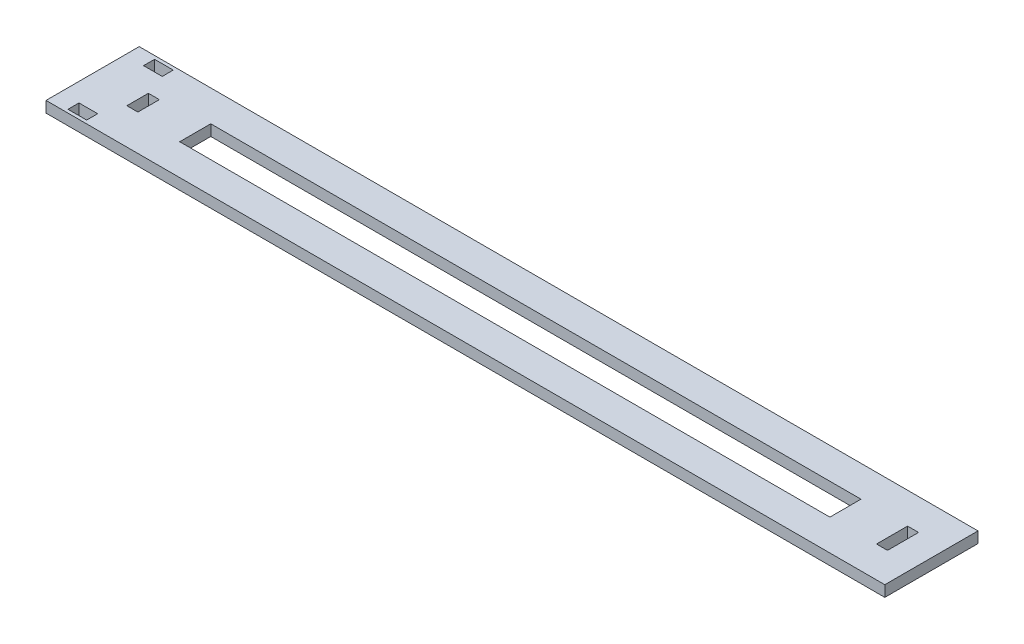
ISO-10303-21;
HEADER;
FILE_DESCRIPTION(('STEP AP214'),'2;1');
FILE_NAME('part.step','',(''),(''),'','','');
FILE_SCHEMA(('AUTOMOTIVE_DESIGN { 1 0 10303 214 1 1 1 1 }'));
ENDSEC;
DATA;
#1=APPLICATION_CONTEXT('core data for automotive mechanical design processes');
#2=APPLICATION_PROTOCOL_DEFINITION('international standard','automotive_design',2000,#1);
#3=PRODUCT_CONTEXT('',#1,'mechanical');
#4=PRODUCT('Part','Part','',(#3));
#5=PRODUCT_RELATED_PRODUCT_CATEGORY('part','',(#4));
#6=PRODUCT_DEFINITION_FORMATION('','',#4);
#7=PRODUCT_DEFINITION_CONTEXT('part definition',#1,'design');
#8=PRODUCT_DEFINITION('design','',#6,#7);
#9=PRODUCT_DEFINITION_SHAPE('','',#8);
#10=(LENGTH_UNIT() NAMED_UNIT(*) SI_UNIT(.MILLI.,.METRE.));
#11=(NAMED_UNIT(*) PLANE_ANGLE_UNIT() SI_UNIT($,.RADIAN.));
#12=(NAMED_UNIT(*) SI_UNIT($,.STERADIAN.) SOLID_ANGLE_UNIT());
#13=UNCERTAINTY_MEASURE_WITH_UNIT(LENGTH_MEASURE(1.E-05),#10,'distance_accuracy_value','');
#14=(GEOMETRIC_REPRESENTATION_CONTEXT(3) GLOBAL_UNCERTAINTY_ASSIGNED_CONTEXT((#13)) GLOBAL_UNIT_ASSIGNED_CONTEXT((#10,
#11,#12)) REPRESENTATION_CONTEXT('',''));
#15=CARTESIAN_POINT('',(0.,0.,0.));
#16=DIRECTION('',(0.,0.,1.));
#17=DIRECTION('',(1.,0.,0.));
#18=AXIS2_PLACEMENT_3D('',#15,#16,#17);
#19=CARTESIAN_POINT('',(0.,6.,0.));
#20=DIRECTION('',(1.,0.,0.));
#21=DIRECTION('',(0.,0.,-1.));
#22=AXIS2_PLACEMENT_3D('',#19,#20,#21);
#23=PLANE('',#22);
#24=DIRECTION('',(0.,0.,1.));
#25=VECTOR('',#24,1.);
#26=CARTESIAN_POINT('',(0.,0.,0.));
#27=LINE('',#26,#25);
#28=CARTESIAN_POINT('',(0.,0.,-50.8));
#29=VERTEX_POINT('',#28);
#30=CARTESIAN_POINT('',(0.,0.,0.));
#31=VERTEX_POINT('',#30);
#32=EDGE_CURVE('E354',#29,#31,#27,.T.);
#33=ORIENTED_EDGE('',*,*,#32,.T.);
#34=DIRECTION('',(0.,-1.,0.));
#35=VECTOR('',#34,1.);
#36=CARTESIAN_POINT('',(0.,6.,0.));
#37=LINE('',#36,#35);
#38=CARTESIAN_POINT('',(0.,6.,0.));
#39=VERTEX_POINT('',#38);
#40=EDGE_CURVE('E11',#39,#31,#37,.T.);
#41=ORIENTED_EDGE('',*,*,#40,.F.);
#42=DIRECTION('',(0.,0.,1.));
#43=VECTOR('',#42,1.);
#44=CARTESIAN_POINT('',(0.,6.,0.));
#45=LINE('',#44,#43);
#46=CARTESIAN_POINT('',(0.,6.,-50.8));
#47=VERTEX_POINT('',#46);
#48=EDGE_CURVE('E355',#47,#39,#45,.T.);
#49=ORIENTED_EDGE('',*,*,#48,.F.);
#50=DIRECTION('',(0.,-1.,0.));
#51=VECTOR('',#50,1.);
#52=CARTESIAN_POINT('',(0.,6.,-50.8));
#53=LINE('',#52,#51);
#54=EDGE_CURVE('E365',#47,#29,#53,.T.);
#55=ORIENTED_EDGE('',*,*,#54,.T.);
#56=EDGE_LOOP('',(#33,#41,#49,#55));
#57=FACE_BOUND('',#56,.T.);
#58=ADVANCED_FACE('F32',(#57),#23,.F.);
#59=CARTESIAN_POINT('',(0.,6.,0.));
#60=DIRECTION('',(0.,0.,-1.));
#61=DIRECTION('',(-1.,0.,0.));
#62=AXIS2_PLACEMENT_3D('',#59,#60,#61);
#63=PLANE('',#62);
#64=DIRECTION('',(1.,0.,0.));
#65=VECTOR('',#64,1.);
#66=CARTESIAN_POINT('',(0.,0.,0.));
#67=LINE('',#66,#65);
#68=CARTESIAN_POINT('',(457.2,0.,0.));
#69=VERTEX_POINT('',#68);
#70=EDGE_CURVE('E368',#31,#69,#67,.T.);
#71=ORIENTED_EDGE('',*,*,#70,.T.);
#72=DIRECTION('',(0.,-1.,0.));
#73=VECTOR('',#72,1.);
#74=CARTESIAN_POINT('',(457.2,6.,0.));
#75=LINE('',#74,#73);
#76=CARTESIAN_POINT('',(457.2,6.,0.));
#77=VERTEX_POINT('',#76);
#78=EDGE_CURVE('E39',#77,#69,#75,.T.);
#79=ORIENTED_EDGE('',*,*,#78,.F.);
#80=DIRECTION('',(1.,0.,0.));
#81=VECTOR('',#80,1.);
#82=CARTESIAN_POINT('',(0.,6.,0.));
#83=LINE('',#82,#81);
#84=EDGE_CURVE('E358',#39,#77,#83,.T.);
#85=ORIENTED_EDGE('',*,*,#84,.F.);
#86=ORIENTED_EDGE('',*,*,#40,.T.);
#87=EDGE_LOOP('',(#71,#79,#85,#86));
#88=FACE_BOUND('',#87,.T.);
#89=ADVANCED_FACE('F397',(#88),#63,.F.);
#90=CARTESIAN_POINT('',(457.2,6.,0.));
#91=DIRECTION('',(-1.,0.,0.));
#92=DIRECTION('',(0.,0.,1.));
#93=AXIS2_PLACEMENT_3D('',#90,#91,#92);
#94=PLANE('',#93);
#95=DIRECTION('',(0.,0.,-1.));
#96=VECTOR('',#95,1.);
#97=CARTESIAN_POINT('',(457.2,0.,0.));
#98=LINE('',#97,#96);
#99=CARTESIAN_POINT('',(457.2,0.,-50.8));
#100=VERTEX_POINT('',#99);
#101=EDGE_CURVE('E370',#69,#100,#98,.T.);
#102=ORIENTED_EDGE('',*,*,#101,.T.);
#103=DIRECTION('',(0.,-1.,0.));
#104=VECTOR('',#103,1.);
#105=CARTESIAN_POINT('',(457.2,6.,-50.8));
#106=LINE('',#105,#104);
#107=CARTESIAN_POINT('',(457.2,6.,-50.8));
#108=VERTEX_POINT('',#107);
#109=EDGE_CURVE('E375',#108,#100,#106,.T.);
#110=ORIENTED_EDGE('',*,*,#109,.F.);
#111=DIRECTION('',(0.,0.,-1.));
#112=VECTOR('',#111,1.);
#113=CARTESIAN_POINT('',(457.2,6.,0.));
#114=LINE('',#113,#112);
#115=EDGE_CURVE('E361',#77,#108,#114,.T.);
#116=ORIENTED_EDGE('',*,*,#115,.F.);
#117=ORIENTED_EDGE('',*,*,#78,.T.);
#118=EDGE_LOOP('',(#102,#110,#116,#117));
#119=FACE_BOUND('',#118,.T.);
#120=ADVANCED_FACE('F382',(#119),#94,.F.);
#121=CARTESIAN_POINT('',(0.,6.,-50.8));
#122=DIRECTION('',(0.,0.,1.));
#123=DIRECTION('',(1.,0.,0.));
#124=AXIS2_PLACEMENT_3D('',#121,#122,#123);
#125=PLANE('',#124);
#126=DIRECTION('',(-1.,0.,0.));
#127=VECTOR('',#126,1.);
#128=CARTESIAN_POINT('',(0.,0.,-50.8));
#129=LINE('',#128,#127);
#130=EDGE_CURVE('E359',#100,#29,#129,.T.);
#131=ORIENTED_EDGE('',*,*,#130,.T.);
#132=ORIENTED_EDGE('',*,*,#54,.F.);
#133=DIRECTION('',(-1.,0.,0.));
#134=VECTOR('',#133,1.);
#135=CARTESIAN_POINT('',(0.,6.,-50.8));
#136=LINE('',#135,#134);
#137=EDGE_CURVE('E363',#108,#47,#136,.T.);
#138=ORIENTED_EDGE('',*,*,#137,.F.);
#139=ORIENTED_EDGE('',*,*,#109,.T.);
#140=EDGE_LOOP('',(#131,#132,#138,#139));
#141=FACE_BOUND('',#140,.T.);
#142=ADVANCED_FACE('F390',(#141),#125,.F.);
#143=CARTESIAN_POINT('',(0.,6.,0.));
#144=DIRECTION('',(0.,-1.,0.));
#145=DIRECTION('',(0.,0.,-1.));
#146=AXIS2_PLACEMENT_3D('',#143,#144,#145);
#147=PLANE('',#146);
#148=DIRECTION('',(0.,0.,-1.));
#149=VECTOR('',#148,1.);
#150=CARTESIAN_POINT('',(410.34,6.,-33.8666666666667));
#151=LINE('',#150,#149);
#152=CARTESIAN_POINT('',(410.34,6.,-16.9333333333334));
#153=VERTEX_POINT('',#152);
#154=CARTESIAN_POINT('',(410.34,6.,-33.8666666666667));
#155=VERTEX_POINT('',#154);
#156=EDGE_CURVE('E209',#153,#155,#151,.T.);
#157=ORIENTED_EDGE('',*,*,#156,.F.);
#158=DIRECTION('',(1.,0.,0.));
#159=VECTOR('',#158,1.);
#160=CARTESIAN_POINT('',(214.894666784463,6.,-16.9333333333333));
#161=LINE('',#160,#159);
#162=CARTESIAN_POINT('',(55.94,6.,-16.9333333333333));
#163=VERTEX_POINT('',#162);
#164=EDGE_CURVE('E46',#163,#153,#161,.T.);
#165=ORIENTED_EDGE('',*,*,#164,.F.);
#166=DIRECTION('',(0.,0.,1.));
#167=VECTOR('',#166,1.);
#168=CARTESIAN_POINT('',(55.94,6.,-16.9333333333333));
#169=LINE('',#168,#167);
#170=CARTESIAN_POINT('',(55.94,6.,-33.8666666666667));
#171=VERTEX_POINT('',#170);
#172=EDGE_CURVE('E219',#171,#163,#169,.T.);
#173=ORIENTED_EDGE('',*,*,#172,.F.);
#174=DIRECTION('',(-1.,0.,0.));
#175=VECTOR('',#174,1.);
#176=CARTESIAN_POINT('',(55.94,6.,-33.8666666666667));
#177=LINE('',#176,#175);
#178=EDGE_CURVE('E211',#155,#171,#177,.T.);
#179=ORIENTED_EDGE('',*,*,#178,.F.);
#180=EDGE_LOOP('',(#157,#165,#173,#179));
#181=FACE_BOUND('',#180,.T.);
#182=DIRECTION('',(1.,0.,0.));
#183=VECTOR('',#182,1.);
#184=CARTESIAN_POINT('',(10.18,6.,-43.));
#185=LINE('',#184,#183);
#186=CARTESIAN_POINT('',(10.18,6.,-43.));
#187=VERTEX_POINT('',#186);
#188=CARTESIAN_POINT('',(20.36,6.,-43.));
#189=VERTEX_POINT('',#188);
#190=EDGE_CURVE('E237',#187,#189,#185,.T.);
#191=ORIENTED_EDGE('',*,*,#190,.F.);
#192=DIRECTION('',(0.,0.,1.));
#193=VECTOR('',#192,1.);
#194=CARTESIAN_POINT('',(10.18,6.,-49.));
#195=LINE('',#194,#193);
#196=CARTESIAN_POINT('',(10.18,6.,-49.));
#197=VERTEX_POINT('',#196);
#198=EDGE_CURVE('E235',#197,#187,#195,.T.);
#199=ORIENTED_EDGE('',*,*,#198,.F.);
#200=DIRECTION('',(-1.,0.,0.));
#201=VECTOR('',#200,1.);
#202=CARTESIAN_POINT('',(10.18,6.,-49.));
#203=LINE('',#202,#201);
#204=CARTESIAN_POINT('',(20.36,6.,-49.));
#205=VERTEX_POINT('',#204);
#206=EDGE_CURVE('E243',#205,#197,#203,.T.);
#207=ORIENTED_EDGE('',*,*,#206,.F.);
#208=DIRECTION('',(0.,0.,-1.));
#209=VECTOR('',#208,1.);
#210=CARTESIAN_POINT('',(20.36,6.,-49.));
#211=LINE('',#210,#209);
#212=EDGE_CURVE('E240',#189,#205,#211,.T.);
#213=ORIENTED_EDGE('',*,*,#212,.F.);
#214=EDGE_LOOP('',(#191,#199,#207,#213));
#215=FACE_BOUND('',#214,.T.);
#216=DIRECTION('',(1.,0.,0.));
#217=VECTOR('',#216,1.);
#218=CARTESIAN_POINT('',(10.18,6.,-1.8));
#219=LINE('',#218,#217);
#220=CARTESIAN_POINT('',(10.18,6.,-1.8));
#221=VERTEX_POINT('',#220);
#222=CARTESIAN_POINT('',(20.36,6.,-1.8));
#223=VERTEX_POINT('',#222);
#224=EDGE_CURVE('E269',#221,#223,#219,.T.);
#225=ORIENTED_EDGE('',*,*,#224,.F.);
#226=DIRECTION('',(0.,0.,1.));
#227=VECTOR('',#226,1.);
#228=CARTESIAN_POINT('',(10.18,6.,-7.8));
#229=LINE('',#228,#227);
#230=CARTESIAN_POINT('',(10.18,6.,-7.8));
#231=VERTEX_POINT('',#230);
#232=EDGE_CURVE('E267',#231,#221,#229,.T.);
#233=ORIENTED_EDGE('',*,*,#232,.F.);
#234=DIRECTION('',(-1.,0.,0.));
#235=VECTOR('',#234,1.);
#236=CARTESIAN_POINT('',(10.18,6.,-7.8));
#237=LINE('',#236,#235);
#238=CARTESIAN_POINT('',(20.36,6.,-7.8));
#239=VERTEX_POINT('',#238);
#240=EDGE_CURVE('E275',#239,#231,#237,.T.);
#241=ORIENTED_EDGE('',*,*,#240,.F.);
#242=DIRECTION('',(0.,0.,-1.));
#243=VECTOR('',#242,1.);
#244=CARTESIAN_POINT('',(20.36,6.,-7.8));
#245=LINE('',#244,#243);
#246=EDGE_CURVE('E272',#223,#239,#245,.T.);
#247=ORIENTED_EDGE('',*,*,#246,.F.);
#248=EDGE_LOOP('',(#225,#233,#241,#247));
#249=FACE_BOUND('',#248,.T.);
#250=DIRECTION('',(1.,0.,0.));
#251=VECTOR('',#250,1.);
#252=CARTESIAN_POINT('',(24.54,6.,-19.5333333333333));
#253=LINE('',#252,#251);
#254=CARTESIAN_POINT('',(24.54,6.,-19.5333333333333));
#255=VERTEX_POINT('',#254);
#256=CARTESIAN_POINT('',(30.54,6.,-19.5333333333333));
#257=VERTEX_POINT('',#256);
#258=EDGE_CURVE('E301',#255,#257,#253,.T.);
#259=ORIENTED_EDGE('',*,*,#258,.F.);
#260=DIRECTION('',(0.,0.,1.));
#261=VECTOR('',#260,1.);
#262=CARTESIAN_POINT('',(24.54,6.,-31.2666666666667));
#263=LINE('',#262,#261);
#264=CARTESIAN_POINT('',(24.54,6.,-31.2666666666667));
#265=VERTEX_POINT('',#264);
#266=EDGE_CURVE('E299',#265,#255,#263,.T.);
#267=ORIENTED_EDGE('',*,*,#266,.F.);
#268=DIRECTION('',(-1.,0.,0.));
#269=VECTOR('',#268,1.);
#270=CARTESIAN_POINT('',(24.54,6.,-31.2666666666667));
#271=LINE('',#270,#269);
#272=CARTESIAN_POINT('',(30.54,6.,-31.2666666666667));
#273=VERTEX_POINT('',#272);
#274=EDGE_CURVE('E307',#273,#265,#271,.T.);
#275=ORIENTED_EDGE('',*,*,#274,.F.);
#276=DIRECTION('',(0.,0.,-1.));
#277=VECTOR('',#276,1.);
#278=CARTESIAN_POINT('',(30.54,6.,-31.2666666666667));
#279=LINE('',#278,#277);
#280=EDGE_CURVE('E304',#257,#273,#279,.T.);
#281=ORIENTED_EDGE('',*,*,#280,.F.);
#282=EDGE_LOOP('',(#259,#267,#275,#281));
#283=FACE_BOUND('',#282,.T.);
#284=DIRECTION('',(-1.,0.,0.));
#285=VECTOR('',#284,1.);
#286=CARTESIAN_POINT('',(441.74,6.,-33.8666666666667));
#287=LINE('',#286,#285);
#288=CARTESIAN_POINT('',(441.74,6.,-33.8666666666667));
#289=VERTEX_POINT('',#288);
#290=CARTESIAN_POINT('',(435.74,6.,-33.8666666666667));
#291=VERTEX_POINT('',#290);
#292=EDGE_CURVE('E333',#289,#291,#287,.T.);
#293=ORIENTED_EDGE('',*,*,#292,.F.);
#294=DIRECTION('',(0.,0.,-1.));
#295=VECTOR('',#294,1.);
#296=CARTESIAN_POINT('',(441.74,6.,-33.8666666666667));
#297=LINE('',#296,#295);
#298=CARTESIAN_POINT('',(441.74,6.,-16.9333333333333));
#299=VERTEX_POINT('',#298);
#300=EDGE_CURVE('E331',#299,#289,#297,.T.);
#301=ORIENTED_EDGE('',*,*,#300,.F.);
#302=DIRECTION('',(1.,0.,0.));
#303=VECTOR('',#302,1.);
#304=CARTESIAN_POINT('',(441.74,6.,-16.9333333333333));
#305=LINE('',#304,#303);
#306=CARTESIAN_POINT('',(435.74,6.,-16.9333333333333));
#307=VERTEX_POINT('',#306);
#308=EDGE_CURVE('E339',#307,#299,#305,.T.);
#309=ORIENTED_EDGE('',*,*,#308,.F.);
#310=DIRECTION('',(0.,0.,1.));
#311=VECTOR('',#310,1.);
#312=CARTESIAN_POINT('',(435.74,6.,-33.8666666666667));
#313=LINE('',#312,#311);
#314=EDGE_CURVE('E336',#291,#307,#313,.T.);
#315=ORIENTED_EDGE('',*,*,#314,.F.);
#316=EDGE_LOOP('',(#293,#301,#309,#315));
#317=FACE_BOUND('',#316,.T.);
#318=ORIENTED_EDGE('',*,*,#48,.T.);
#319=ORIENTED_EDGE('',*,*,#84,.T.);
#320=ORIENTED_EDGE('',*,*,#115,.T.);
#321=ORIENTED_EDGE('',*,*,#137,.T.);
#322=EDGE_LOOP('',(#318,#319,#320,#321));
#323=FACE_BOUND('',#322,.T.);
#324=ADVANCED_FACE('F396',(#181,#215,#249,#283,#317,#323),#147,.F.);
#325=CARTESIAN_POINT('',(0.,0.,0.));
#326=DIRECTION('',(0.,-1.,0.));
#327=DIRECTION('',(0.,0.,-1.));
#328=AXIS2_PLACEMENT_3D('',#325,#326,#327);
#329=PLANE('',#328);
#330=DIRECTION('',(1.,0.,0.));
#331=VECTOR('',#330,1.);
#332=CARTESIAN_POINT('',(214.894666784463,0.,-16.9333333333333));
#333=LINE('',#332,#331);
#334=CARTESIAN_POINT('',(55.94,0.,-16.9333333333333));
#335=VERTEX_POINT('',#334);
#336=CARTESIAN_POINT('',(410.34,0.,-16.9333333333334));
#337=VERTEX_POINT('',#336);
#338=EDGE_CURVE('E202',#335,#337,#333,.T.);
#339=ORIENTED_EDGE('',*,*,#338,.T.);
#340=DIRECTION('',(0.,0.,-1.));
#341=VECTOR('',#340,1.);
#342=CARTESIAN_POINT('',(410.34,0.,-33.8666666666667));
#343=LINE('',#342,#341);
#344=CARTESIAN_POINT('',(410.34,0.,-33.8666666666667));
#345=VERTEX_POINT('',#344);
#346=EDGE_CURVE('E191',#337,#345,#343,.T.);
#347=ORIENTED_EDGE('',*,*,#346,.T.);
#348=DIRECTION('',(-1.,0.,0.));
#349=VECTOR('',#348,1.);
#350=CARTESIAN_POINT('',(55.94,0.,-33.8666666666667));
#351=LINE('',#350,#349);
#352=CARTESIAN_POINT('',(55.94,0.,-33.8666666666667));
#353=VERTEX_POINT('',#352);
#354=EDGE_CURVE('E213',#345,#353,#351,.T.);
#355=ORIENTED_EDGE('',*,*,#354,.T.);
#356=DIRECTION('',(0.,0.,1.));
#357=VECTOR('',#356,1.);
#358=CARTESIAN_POINT('',(55.94,0.,-16.9333333333333));
#359=LINE('',#358,#357);
#360=EDGE_CURVE('E208',#353,#335,#359,.T.);
#361=ORIENTED_EDGE('',*,*,#360,.T.);
#362=EDGE_LOOP('',(#339,#347,#355,#361));
#363=FACE_BOUND('',#362,.T.);
#364=DIRECTION('',(0.,0.,1.));
#365=VECTOR('',#364,1.);
#366=CARTESIAN_POINT('',(10.18,0.,-49.));
#367=LINE('',#366,#365);
#368=CARTESIAN_POINT('',(10.18,0.,-49.));
#369=VERTEX_POINT('',#368);
#370=CARTESIAN_POINT('',(10.18,0.,-43.));
#371=VERTEX_POINT('',#370);
#372=EDGE_CURVE('E232',#369,#371,#367,.T.);
#373=ORIENTED_EDGE('',*,*,#372,.T.);
#374=DIRECTION('',(1.,0.,0.));
#375=VECTOR('',#374,1.);
#376=CARTESIAN_POINT('',(10.18,0.,-43.));
#377=LINE('',#376,#375);
#378=CARTESIAN_POINT('',(20.36,0.,-43.));
#379=VERTEX_POINT('',#378);
#380=EDGE_CURVE('E249',#371,#379,#377,.T.);
#381=ORIENTED_EDGE('',*,*,#380,.T.);
#382=DIRECTION('',(0.,0.,-1.));
#383=VECTOR('',#382,1.);
#384=CARTESIAN_POINT('',(20.36,0.,-49.));
#385=LINE('',#384,#383);
#386=CARTESIAN_POINT('',(20.36,0.,-49.));
#387=VERTEX_POINT('',#386);
#388=EDGE_CURVE('E198',#379,#387,#385,.T.);
#389=ORIENTED_EDGE('',*,*,#388,.T.);
#390=DIRECTION('',(-1.,0.,0.));
#391=VECTOR('',#390,1.);
#392=CARTESIAN_POINT('',(10.18,0.,-49.));
#393=LINE('',#392,#391);
#394=EDGE_CURVE('E229',#387,#369,#393,.T.);
#395=ORIENTED_EDGE('',*,*,#394,.T.);
#396=EDGE_LOOP('',(#373,#381,#389,#395));
#397=FACE_BOUND('',#396,.T.);
#398=DIRECTION('',(0.,0.,1.));
#399=VECTOR('',#398,1.);
#400=CARTESIAN_POINT('',(10.18,0.,-7.8));
#401=LINE('',#400,#399);
#402=CARTESIAN_POINT('',(10.18,0.,-7.8));
#403=VERTEX_POINT('',#402);
#404=CARTESIAN_POINT('',(10.18,0.,-1.8));
#405=VERTEX_POINT('',#404);
#406=EDGE_CURVE('E264',#403,#405,#401,.T.);
#407=ORIENTED_EDGE('',*,*,#406,.T.);
#408=DIRECTION('',(1.,0.,0.));
#409=VECTOR('',#408,1.);
#410=CARTESIAN_POINT('',(10.18,0.,-1.8));
#411=LINE('',#410,#409);
#412=CARTESIAN_POINT('',(20.36,0.,-1.8));
#413=VERTEX_POINT('',#412);
#414=EDGE_CURVE('E281',#405,#413,#411,.T.);
#415=ORIENTED_EDGE('',*,*,#414,.T.);
#416=DIRECTION('',(0.,0.,-1.));
#417=VECTOR('',#416,1.);
#418=CARTESIAN_POINT('',(20.36,0.,-7.8));
#419=LINE('',#418,#417);
#420=CARTESIAN_POINT('',(20.36,0.,-7.8));
#421=VERTEX_POINT('',#420);
#422=EDGE_CURVE('E258',#413,#421,#419,.T.);
#423=ORIENTED_EDGE('',*,*,#422,.T.);
#424=DIRECTION('',(-1.,0.,0.));
#425=VECTOR('',#424,1.);
#426=CARTESIAN_POINT('',(10.18,0.,-7.8));
#427=LINE('',#426,#425);
#428=EDGE_CURVE('E261',#421,#403,#427,.T.);
#429=ORIENTED_EDGE('',*,*,#428,.T.);
#430=EDGE_LOOP('',(#407,#415,#423,#429));
#431=FACE_BOUND('',#430,.T.);
#432=DIRECTION('',(0.,0.,1.));
#433=VECTOR('',#432,1.);
#434=CARTESIAN_POINT('',(24.54,0.,-31.2666666666667));
#435=LINE('',#434,#433);
#436=CARTESIAN_POINT('',(24.54,0.,-31.2666666666667));
#437=VERTEX_POINT('',#436);
#438=CARTESIAN_POINT('',(24.54,0.,-19.5333333333333));
#439=VERTEX_POINT('',#438);
#440=EDGE_CURVE('E296',#437,#439,#435,.T.);
#441=ORIENTED_EDGE('',*,*,#440,.T.);
#442=DIRECTION('',(1.,0.,0.));
#443=VECTOR('',#442,1.);
#444=CARTESIAN_POINT('',(24.54,0.,-19.5333333333333));
#445=LINE('',#444,#443);
#446=CARTESIAN_POINT('',(30.54,0.,-19.5333333333333));
#447=VERTEX_POINT('',#446);
#448=EDGE_CURVE('E313',#439,#447,#445,.T.);
#449=ORIENTED_EDGE('',*,*,#448,.T.);
#450=DIRECTION('',(0.,0.,-1.));
#451=VECTOR('',#450,1.);
#452=CARTESIAN_POINT('',(30.54,0.,-31.2666666666667));
#453=LINE('',#452,#451);
#454=CARTESIAN_POINT('',(30.54,0.,-31.2666666666667));
#455=VERTEX_POINT('',#454);
#456=EDGE_CURVE('E290',#447,#455,#453,.T.);
#457=ORIENTED_EDGE('',*,*,#456,.T.);
#458=DIRECTION('',(-1.,0.,0.));
#459=VECTOR('',#458,1.);
#460=CARTESIAN_POINT('',(24.54,0.,-31.2666666666667));
#461=LINE('',#460,#459);
#462=EDGE_CURVE('E293',#455,#437,#461,.T.);
#463=ORIENTED_EDGE('',*,*,#462,.T.);
#464=EDGE_LOOP('',(#441,#449,#457,#463));
#465=FACE_BOUND('',#464,.T.);
#466=DIRECTION('',(0.,0.,-1.));
#467=VECTOR('',#466,1.);
#468=CARTESIAN_POINT('',(441.74,0.,-33.8666666666667));
#469=LINE('',#468,#467);
#470=CARTESIAN_POINT('',(441.74,0.,-16.9333333333333));
#471=VERTEX_POINT('',#470);
#472=CARTESIAN_POINT('',(441.74,0.,-33.8666666666667));
#473=VERTEX_POINT('',#472);
#474=EDGE_CURVE('E328',#471,#473,#469,.T.);
#475=ORIENTED_EDGE('',*,*,#474,.T.);
#476=DIRECTION('',(-1.,0.,0.));
#477=VECTOR('',#476,1.);
#478=CARTESIAN_POINT('',(441.74,0.,-33.8666666666667));
#479=LINE('',#478,#477);
#480=CARTESIAN_POINT('',(435.74,0.,-33.8666666666667));
#481=VERTEX_POINT('',#480);
#482=EDGE_CURVE('E345',#473,#481,#479,.T.);
#483=ORIENTED_EDGE('',*,*,#482,.T.);
#484=DIRECTION('',(0.,0.,1.));
#485=VECTOR('',#484,1.);
#486=CARTESIAN_POINT('',(435.74,0.,-33.8666666666667));
#487=LINE('',#486,#485);
#488=CARTESIAN_POINT('',(435.74,0.,-16.9333333333333));
#489=VERTEX_POINT('',#488);
#490=EDGE_CURVE('E322',#481,#489,#487,.T.);
#491=ORIENTED_EDGE('',*,*,#490,.T.);
#492=DIRECTION('',(1.,0.,0.));
#493=VECTOR('',#492,1.);
#494=CARTESIAN_POINT('',(441.74,0.,-16.9333333333333));
#495=LINE('',#494,#493);
#496=EDGE_CURVE('E325',#489,#471,#495,.T.);
#497=ORIENTED_EDGE('',*,*,#496,.T.);
#498=EDGE_LOOP('',(#475,#483,#491,#497));
#499=FACE_BOUND('',#498,.T.);
#500=ORIENTED_EDGE('',*,*,#32,.F.);
#501=ORIENTED_EDGE('',*,*,#130,.F.);
#502=ORIENTED_EDGE('',*,*,#101,.F.);
#503=ORIENTED_EDGE('',*,*,#70,.F.);
#504=EDGE_LOOP('',(#500,#501,#502,#503));
#505=FACE_BOUND('',#504,.T.);
#506=ADVANCED_FACE('F206',(#363,#397,#431,#465,#499,#505),#329,.T.);
#507=CARTESIAN_POINT('',(441.74,-0.00100000000000013,-33.8666666666667));
#508=DIRECTION('',(1.,0.,0.));
#509=DIRECTION('',(0.,0.,-1.));
#510=AXIS2_PLACEMENT_3D('',#507,#508,#509);
#511=PLANE('',#510);
#512=DIRECTION('',(0.,1.,0.));
#513=VECTOR('',#512,1.);
#514=CARTESIAN_POINT('',(441.74,-0.00100000000000013,-16.9333333333333));
#515=LINE('',#514,#513);
#516=EDGE_CURVE('E343',#471,#299,#515,.T.);
#517=ORIENTED_EDGE('',*,*,#516,.T.);
#518=ORIENTED_EDGE('',*,*,#300,.T.);
#519=DIRECTION('',(0.,1.,0.));
#520=VECTOR('',#519,1.);
#521=CARTESIAN_POINT('',(441.74,-0.00100000000000013,-33.8666666666667));
#522=LINE('',#521,#520);
#523=EDGE_CURVE('E342',#473,#289,#522,.T.);
#524=ORIENTED_EDGE('',*,*,#523,.F.);
#525=ORIENTED_EDGE('',*,*,#474,.F.);
#526=EDGE_LOOP('',(#517,#518,#524,#525));
#527=FACE_BOUND('',#526,.T.);
#528=ADVANCED_FACE('F409',(#527),#511,.F.);
#529=CARTESIAN_POINT('',(441.74,-0.00100000000000013,-16.9333333333333));
#530=DIRECTION('',(0.,0.,1.));
#531=DIRECTION('',(1.,0.,0.));
#532=AXIS2_PLACEMENT_3D('',#529,#530,#531);
#533=PLANE('',#532);
#534=DIRECTION('',(0.,1.,0.));
#535=VECTOR('',#534,1.);
#536=CARTESIAN_POINT('',(435.74,-0.00100000000000013,-16.9333333333333));
#537=LINE('',#536,#535);
#538=EDGE_CURVE('E346',#489,#307,#537,.T.);
#539=ORIENTED_EDGE('',*,*,#538,.T.);
#540=ORIENTED_EDGE('',*,*,#308,.T.);
#541=ORIENTED_EDGE('',*,*,#516,.F.);
#542=ORIENTED_EDGE('',*,*,#496,.F.);
#543=EDGE_LOOP('',(#539,#540,#541,#542));
#544=FACE_BOUND('',#543,.T.);
#545=ADVANCED_FACE('F415',(#544),#533,.F.);
#546=CARTESIAN_POINT('',(435.74,-0.00100000000000013,-33.8666666666667));
#547=DIRECTION('',(-1.,0.,0.));
#548=DIRECTION('',(0.,0.,1.));
#549=AXIS2_PLACEMENT_3D('',#546,#547,#548);
#550=PLANE('',#549);
#551=DIRECTION('',(0.,1.,0.));
#552=VECTOR('',#551,1.);
#553=CARTESIAN_POINT('',(435.74,-0.00100000000000013,-33.8666666666667));
#554=LINE('',#553,#552);
#555=EDGE_CURVE('E348',#481,#291,#554,.T.);
#556=ORIENTED_EDGE('',*,*,#555,.T.);
#557=ORIENTED_EDGE('',*,*,#314,.T.);
#558=ORIENTED_EDGE('',*,*,#538,.F.);
#559=ORIENTED_EDGE('',*,*,#490,.F.);
#560=EDGE_LOOP('',(#556,#557,#558,#559));
#561=FACE_BOUND('',#560,.T.);
#562=ADVANCED_FACE('F421',(#561),#550,.F.);
#563=CARTESIAN_POINT('',(441.74,-0.00100000000000013,-33.8666666666667));
#564=DIRECTION('',(0.,0.,-1.));
#565=DIRECTION('',(-1.,0.,0.));
#566=AXIS2_PLACEMENT_3D('',#563,#564,#565);
#567=PLANE('',#566);
#568=ORIENTED_EDGE('',*,*,#523,.T.);
#569=ORIENTED_EDGE('',*,*,#292,.T.);
#570=ORIENTED_EDGE('',*,*,#555,.F.);
#571=ORIENTED_EDGE('',*,*,#482,.F.);
#572=EDGE_LOOP('',(#568,#569,#570,#571));
#573=FACE_BOUND('',#572,.T.);
#574=ADVANCED_FACE('F417',(#573),#567,.F.);
#575=CARTESIAN_POINT('',(24.54,-0.00100000000000013,-31.2666666666667));
#576=DIRECTION('',(-1.,0.,0.));
#577=DIRECTION('',(0.,0.,1.));
#578=AXIS2_PLACEMENT_3D('',#575,#576,#577);
#579=PLANE('',#578);
#580=DIRECTION('',(0.,1.,0.));
#581=VECTOR('',#580,1.);
#582=CARTESIAN_POINT('',(24.54,-0.00100000000000013,-31.2666666666667));
#583=LINE('',#582,#581);
#584=EDGE_CURVE('E311',#437,#265,#583,.T.);
#585=ORIENTED_EDGE('',*,*,#584,.T.);
#586=ORIENTED_EDGE('',*,*,#266,.T.);
#587=DIRECTION('',(0.,1.,0.));
#588=VECTOR('',#587,1.);
#589=CARTESIAN_POINT('',(24.54,-0.00100000000000013,-19.5333333333333));
#590=LINE('',#589,#588);
#591=EDGE_CURVE('E310',#439,#255,#590,.T.);
#592=ORIENTED_EDGE('',*,*,#591,.F.);
#593=ORIENTED_EDGE('',*,*,#440,.F.);
#594=EDGE_LOOP('',(#585,#586,#592,#593));
#595=FACE_BOUND('',#594,.T.);
#596=ADVANCED_FACE('F420',(#595),#579,.F.);
#597=CARTESIAN_POINT('',(24.54,-0.00100000000000013,-31.2666666666667));
#598=DIRECTION('',(0.,0.,-1.));
#599=DIRECTION('',(-1.,0.,0.));
#600=AXIS2_PLACEMENT_3D('',#597,#598,#599);
#601=PLANE('',#600);
#602=DIRECTION('',(0.,1.,0.));
#603=VECTOR('',#602,1.);
#604=CARTESIAN_POINT('',(30.54,-0.00100000000000013,-31.2666666666667));
#605=LINE('',#604,#603);
#606=EDGE_CURVE('E314',#455,#273,#605,.T.);
#607=ORIENTED_EDGE('',*,*,#606,.T.);
#608=ORIENTED_EDGE('',*,*,#274,.T.);
#609=ORIENTED_EDGE('',*,*,#584,.F.);
#610=ORIENTED_EDGE('',*,*,#462,.F.);
#611=EDGE_LOOP('',(#607,#608,#609,#610));
#612=FACE_BOUND('',#611,.T.);
#613=ADVANCED_FACE('F431',(#612),#601,.F.);
#614=CARTESIAN_POINT('',(30.54,-0.00100000000000013,-31.2666666666667));
#615=DIRECTION('',(1.,0.,0.));
#616=DIRECTION('',(0.,0.,-1.));
#617=AXIS2_PLACEMENT_3D('',#614,#615,#616);
#618=PLANE('',#617);
#619=DIRECTION('',(0.,1.,0.));
#620=VECTOR('',#619,1.);
#621=CARTESIAN_POINT('',(30.54,-0.00100000000000013,-19.5333333333333));
#622=LINE('',#621,#620);
#623=EDGE_CURVE('E316',#447,#257,#622,.T.);
#624=ORIENTED_EDGE('',*,*,#623,.T.);
#625=ORIENTED_EDGE('',*,*,#280,.T.);
#626=ORIENTED_EDGE('',*,*,#606,.F.);
#627=ORIENTED_EDGE('',*,*,#456,.F.);
#628=EDGE_LOOP('',(#624,#625,#626,#627));
#629=FACE_BOUND('',#628,.T.);
#630=ADVANCED_FACE('F437',(#629),#618,.F.);
#631=CARTESIAN_POINT('',(24.54,-0.00100000000000013,-19.5333333333333));
#632=DIRECTION('',(0.,0.,1.));
#633=DIRECTION('',(1.,0.,0.));
#634=AXIS2_PLACEMENT_3D('',#631,#632,#633);
#635=PLANE('',#634);
#636=ORIENTED_EDGE('',*,*,#591,.T.);
#637=ORIENTED_EDGE('',*,*,#258,.T.);
#638=ORIENTED_EDGE('',*,*,#623,.F.);
#639=ORIENTED_EDGE('',*,*,#448,.F.);
#640=EDGE_LOOP('',(#636,#637,#638,#639));
#641=FACE_BOUND('',#640,.T.);
#642=ADVANCED_FACE('F433',(#641),#635,.F.);
#643=CARTESIAN_POINT('',(10.18,-0.00100000000000013,-7.8));
#644=DIRECTION('',(-1.,0.,0.));
#645=DIRECTION('',(0.,0.,1.));
#646=AXIS2_PLACEMENT_3D('',#643,#644,#645);
#647=PLANE('',#646);
#648=DIRECTION('',(0.,1.,0.));
#649=VECTOR('',#648,1.);
#650=CARTESIAN_POINT('',(10.18,-0.00100000000000013,-7.8));
#651=LINE('',#650,#649);
#652=EDGE_CURVE('E279',#403,#231,#651,.T.);
#653=ORIENTED_EDGE('',*,*,#652,.T.);
#654=ORIENTED_EDGE('',*,*,#232,.T.);
#655=DIRECTION('',(0.,1.,0.));
#656=VECTOR('',#655,1.);
#657=CARTESIAN_POINT('',(10.18,-0.00100000000000013,-1.8));
#658=LINE('',#657,#656);
#659=EDGE_CURVE('E278',#405,#221,#658,.T.);
#660=ORIENTED_EDGE('',*,*,#659,.F.);
#661=ORIENTED_EDGE('',*,*,#406,.F.);
#662=EDGE_LOOP('',(#653,#654,#660,#661));
#663=FACE_BOUND('',#662,.T.);
#664=ADVANCED_FACE('F436',(#663),#647,.F.);
#665=CARTESIAN_POINT('',(10.18,-0.00100000000000013,-7.8));
#666=DIRECTION('',(0.,0.,-1.));
#667=DIRECTION('',(-1.,0.,0.));
#668=AXIS2_PLACEMENT_3D('',#665,#666,#667);
#669=PLANE('',#668);
#670=DIRECTION('',(0.,1.,0.));
#671=VECTOR('',#670,1.);
#672=CARTESIAN_POINT('',(20.36,-0.00100000000000013,-7.8));
#673=LINE('',#672,#671);
#674=EDGE_CURVE('E282',#421,#239,#673,.T.);
#675=ORIENTED_EDGE('',*,*,#674,.T.);
#676=ORIENTED_EDGE('',*,*,#240,.T.);
#677=ORIENTED_EDGE('',*,*,#652,.F.);
#678=ORIENTED_EDGE('',*,*,#428,.F.);
#679=EDGE_LOOP('',(#675,#676,#677,#678));
#680=FACE_BOUND('',#679,.T.);
#681=ADVANCED_FACE('F447',(#680),#669,.F.);
#682=CARTESIAN_POINT('',(20.36,-0.00100000000000013,-7.8));
#683=DIRECTION('',(1.,0.,0.));
#684=DIRECTION('',(0.,0.,-1.));
#685=AXIS2_PLACEMENT_3D('',#682,#683,#684);
#686=PLANE('',#685);
#687=DIRECTION('',(0.,1.,0.));
#688=VECTOR('',#687,1.);
#689=CARTESIAN_POINT('',(20.36,-0.00100000000000013,-1.8));
#690=LINE('',#689,#688);
#691=EDGE_CURVE('E284',#413,#223,#690,.T.);
#692=ORIENTED_EDGE('',*,*,#691,.T.);
#693=ORIENTED_EDGE('',*,*,#246,.T.);
#694=ORIENTED_EDGE('',*,*,#674,.F.);
#695=ORIENTED_EDGE('',*,*,#422,.F.);
#696=EDGE_LOOP('',(#692,#693,#694,#695));
#697=FACE_BOUND('',#696,.T.);
#698=ADVANCED_FACE('F453',(#697),#686,.F.);
#699=CARTESIAN_POINT('',(10.18,-0.00100000000000013,-1.8));
#700=DIRECTION('',(0.,0.,1.));
#701=DIRECTION('',(1.,0.,0.));
#702=AXIS2_PLACEMENT_3D('',#699,#700,#701);
#703=PLANE('',#702);
#704=ORIENTED_EDGE('',*,*,#659,.T.);
#705=ORIENTED_EDGE('',*,*,#224,.T.);
#706=ORIENTED_EDGE('',*,*,#691,.F.);
#707=ORIENTED_EDGE('',*,*,#414,.F.);
#708=EDGE_LOOP('',(#704,#705,#706,#707));
#709=FACE_BOUND('',#708,.T.);
#710=ADVANCED_FACE('F449',(#709),#703,.F.);
#711=CARTESIAN_POINT('',(10.18,-0.00100000000000013,-49.));
#712=DIRECTION('',(-1.,0.,0.));
#713=DIRECTION('',(0.,0.,1.));
#714=AXIS2_PLACEMENT_3D('',#711,#712,#713);
#715=PLANE('',#714);
#716=DIRECTION('',(0.,1.,0.));
#717=VECTOR('',#716,1.);
#718=CARTESIAN_POINT('',(10.18,-0.00100000000000013,-49.));
#719=LINE('',#718,#717);
#720=EDGE_CURVE('E247',#369,#197,#719,.T.);
#721=ORIENTED_EDGE('',*,*,#720,.T.);
#722=ORIENTED_EDGE('',*,*,#198,.T.);
#723=DIRECTION('',(0.,1.,0.));
#724=VECTOR('',#723,1.);
#725=CARTESIAN_POINT('',(10.18,-0.00100000000000013,-43.));
#726=LINE('',#725,#724);
#727=EDGE_CURVE('E246',#371,#187,#726,.T.);
#728=ORIENTED_EDGE('',*,*,#727,.F.);
#729=ORIENTED_EDGE('',*,*,#372,.F.);
#730=EDGE_LOOP('',(#721,#722,#728,#729));
#731=FACE_BOUND('',#730,.T.);
#732=ADVANCED_FACE('F452',(#731),#715,.F.);
#733=CARTESIAN_POINT('',(10.18,-0.00100000000000013,-49.));
#734=DIRECTION('',(0.,0.,-1.));
#735=DIRECTION('',(-1.,0.,0.));
#736=AXIS2_PLACEMENT_3D('',#733,#734,#735);
#737=PLANE('',#736);
#738=DIRECTION('',(0.,1.,0.));
#739=VECTOR('',#738,1.);
#740=CARTESIAN_POINT('',(20.36,-0.00100000000000013,-49.));
#741=LINE('',#740,#739);
#742=EDGE_CURVE('E250',#387,#205,#741,.T.);
#743=ORIENTED_EDGE('',*,*,#742,.T.);
#744=ORIENTED_EDGE('',*,*,#206,.T.);
#745=ORIENTED_EDGE('',*,*,#720,.F.);
#746=ORIENTED_EDGE('',*,*,#394,.F.);
#747=EDGE_LOOP('',(#743,#744,#745,#746));
#748=FACE_BOUND('',#747,.T.);
#749=ADVANCED_FACE('F463',(#748),#737,.F.);
#750=CARTESIAN_POINT('',(20.36,-0.00100000000000013,-49.));
#751=DIRECTION('',(1.,0.,0.));
#752=DIRECTION('',(0.,0.,-1.));
#753=AXIS2_PLACEMENT_3D('',#750,#751,#752);
#754=PLANE('',#753);
#755=DIRECTION('',(0.,1.,0.));
#756=VECTOR('',#755,1.);
#757=CARTESIAN_POINT('',(20.36,-0.00100000000000013,-43.));
#758=LINE('',#757,#756);
#759=EDGE_CURVE('E252',#379,#189,#758,.T.);
#760=ORIENTED_EDGE('',*,*,#759,.T.);
#761=ORIENTED_EDGE('',*,*,#212,.T.);
#762=ORIENTED_EDGE('',*,*,#742,.F.);
#763=ORIENTED_EDGE('',*,*,#388,.F.);
#764=EDGE_LOOP('',(#760,#761,#762,#763));
#765=FACE_BOUND('',#764,.T.);
#766=ADVANCED_FACE('F468',(#765),#754,.F.);
#767=CARTESIAN_POINT('',(10.18,-0.00100000000000013,-43.));
#768=DIRECTION('',(0.,0.,1.));
#769=DIRECTION('',(1.,0.,0.));
#770=AXIS2_PLACEMENT_3D('',#767,#768,#769);
#771=PLANE('',#770);
#772=ORIENTED_EDGE('',*,*,#727,.T.);
#773=ORIENTED_EDGE('',*,*,#190,.T.);
#774=ORIENTED_EDGE('',*,*,#759,.F.);
#775=ORIENTED_EDGE('',*,*,#380,.F.);
#776=EDGE_LOOP('',(#772,#773,#774,#775));
#777=FACE_BOUND('',#776,.T.);
#778=ADVANCED_FACE('F465',(#777),#771,.F.);
#779=CARTESIAN_POINT('',(214.894666784463,-0.00100000000000013,-16.9333333333333));
#780=DIRECTION('',(0.,0.,1.));
#781=DIRECTION('',(1.,0.,0.));
#782=AXIS2_PLACEMENT_3D('',#779,#780,#781);
#783=PLANE('',#782);
#784=DIRECTION('',(0.,1.,0.));
#785=VECTOR('',#784,1.);
#786=CARTESIAN_POINT('',(55.94,-0.00100000000000013,-16.9333333333333));
#787=LINE('',#786,#785);
#788=EDGE_CURVE('E199',#335,#163,#787,.T.);
#789=ORIENTED_EDGE('',*,*,#788,.T.);
#790=ORIENTED_EDGE('',*,*,#164,.T.);
#791=DIRECTION('',(0.,1.,0.));
#792=VECTOR('',#791,1.);
#793=CARTESIAN_POINT('',(410.34,-0.00100000000000013,-16.9333333333334));
#794=LINE('',#793,#792);
#795=EDGE_CURVE('E193',#337,#153,#794,.T.);
#796=ORIENTED_EDGE('',*,*,#795,.F.);
#797=ORIENTED_EDGE('',*,*,#338,.F.);
#798=EDGE_LOOP('',(#789,#790,#796,#797));
#799=FACE_BOUND('',#798,.T.);
#800=ADVANCED_FACE('F201',(#799),#783,.F.);
#801=CARTESIAN_POINT('',(55.94,-0.00100000000000013,-16.9333333333333));
#802=DIRECTION('',(-1.,0.,0.));
#803=DIRECTION('',(0.,0.,1.));
#804=AXIS2_PLACEMENT_3D('',#801,#802,#803);
#805=PLANE('',#804);
#806=DIRECTION('',(0.,1.,0.));
#807=VECTOR('',#806,1.);
#808=CARTESIAN_POINT('',(55.94,-0.00100000000000013,-33.8666666666667));
#809=LINE('',#808,#807);
#810=EDGE_CURVE('E224',#353,#171,#809,.T.);
#811=ORIENTED_EDGE('',*,*,#810,.T.);
#812=ORIENTED_EDGE('',*,*,#172,.T.);
#813=ORIENTED_EDGE('',*,*,#788,.F.);
#814=ORIENTED_EDGE('',*,*,#360,.F.);
#815=EDGE_LOOP('',(#811,#812,#813,#814));
#816=FACE_BOUND('',#815,.T.);
#817=ADVANCED_FACE('F481',(#816),#805,.F.);
#818=CARTESIAN_POINT('',(55.94,-0.00100000000000013,-33.8666666666667));
#819=DIRECTION('',(0.,0.,-1.));
#820=DIRECTION('',(-1.,0.,0.));
#821=AXIS2_PLACEMENT_3D('',#818,#819,#820);
#822=PLANE('',#821);
#823=DIRECTION('',(0.,1.,0.));
#824=VECTOR('',#823,1.);
#825=CARTESIAN_POINT('',(410.34,-0.00100000000000013,-33.8666666666667));
#826=LINE('',#825,#824);
#827=EDGE_CURVE('E54',#345,#155,#826,.T.);
#828=ORIENTED_EDGE('',*,*,#827,.T.);
#829=ORIENTED_EDGE('',*,*,#178,.T.);
#830=ORIENTED_EDGE('',*,*,#810,.F.);
#831=ORIENTED_EDGE('',*,*,#354,.F.);
#832=EDGE_LOOP('',(#828,#829,#830,#831));
#833=FACE_BOUND('',#832,.T.);
#834=ADVANCED_FACE('F478',(#833),#822,.F.);
#835=CARTESIAN_POINT('',(410.34,-0.00100000000000013,-33.8666666666667));
#836=DIRECTION('',(1.,0.,0.));
#837=DIRECTION('',(0.,0.,-1.));
#838=AXIS2_PLACEMENT_3D('',#835,#836,#837);
#839=PLANE('',#838);
#840=ORIENTED_EDGE('',*,*,#795,.T.);
#841=ORIENTED_EDGE('',*,*,#156,.T.);
#842=ORIENTED_EDGE('',*,*,#827,.F.);
#843=ORIENTED_EDGE('',*,*,#346,.F.);
#844=EDGE_LOOP('',(#840,#841,#842,#843));
#845=FACE_BOUND('',#844,.T.);
#846=ADVANCED_FACE('F192',(#845),#839,.F.);
#847=CLOSED_SHELL('',(#58,#89,#120,#142,#324,#506,#528,#545,#562,#574,#596,#613,#630,#642,#664,
#681,#698,#710,#732,#749,#766,#778,#800,#817,#834,#846));
#848=MANIFOLD_SOLID_BREP('B2',#847);
#849=ADVANCED_BREP_SHAPE_REPRESENTATION('',(#18,#848),#14);
#850=SHAPE_DEFINITION_REPRESENTATION(#9,#849);
ENDSEC;
END-ISO-10303-21;
